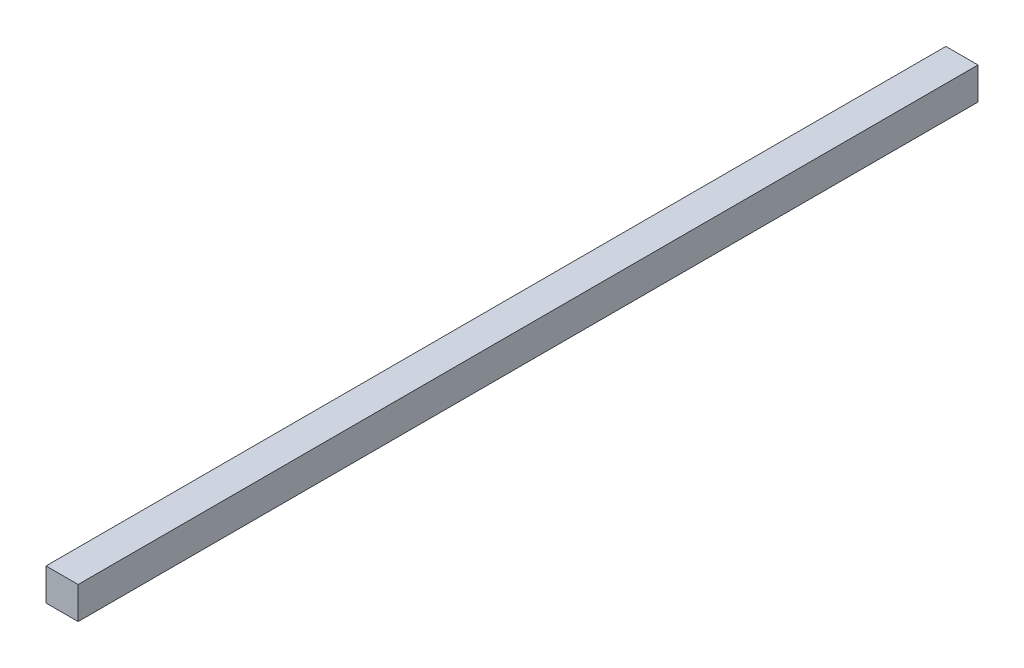
ISO-10303-21;
HEADER;
FILE_DESCRIPTION(('STEP AP214'),'2;1');
FILE_NAME('part.step','',(''),(''),'','','');
FILE_SCHEMA(('AUTOMOTIVE_DESIGN { 1 0 10303 214 1 1 1 1 }'));
ENDSEC;
DATA;
#1=APPLICATION_CONTEXT('core data for automotive mechanical design processes');
#2=APPLICATION_PROTOCOL_DEFINITION('international standard','automotive_design',2000,#1);
#3=PRODUCT_CONTEXT('',#1,'mechanical');
#4=PRODUCT('Part','Part','',(#3));
#5=PRODUCT_RELATED_PRODUCT_CATEGORY('part','',(#4));
#6=PRODUCT_DEFINITION_FORMATION('','',#4);
#7=PRODUCT_DEFINITION_CONTEXT('part definition',#1,'design');
#8=PRODUCT_DEFINITION('design','',#6,#7);
#9=PRODUCT_DEFINITION_SHAPE('','',#8);
#10=(LENGTH_UNIT() NAMED_UNIT(*) SI_UNIT(.MILLI.,.METRE.));
#11=(NAMED_UNIT(*) PLANE_ANGLE_UNIT() SI_UNIT($,.RADIAN.));
#12=(NAMED_UNIT(*) SI_UNIT($,.STERADIAN.) SOLID_ANGLE_UNIT());
#13=UNCERTAINTY_MEASURE_WITH_UNIT(LENGTH_MEASURE(1.E-05),#10,'distance_accuracy_value','');
#14=(GEOMETRIC_REPRESENTATION_CONTEXT(3) GLOBAL_UNCERTAINTY_ASSIGNED_CONTEXT((#13)) GLOBAL_UNIT_ASSIGNED_CONTEXT((#10,
#11,#12)) REPRESENTATION_CONTEXT('',''));
#15=CARTESIAN_POINT('',(0.,0.,0.));
#16=DIRECTION('',(0.,0.,1.));
#17=DIRECTION('',(1.,0.,0.));
#18=AXIS2_PLACEMENT_3D('',#15,#16,#17);
#19=CARTESIAN_POINT('',(7.5,-7.5,420.));
#20=DIRECTION('',(-1.,0.,0.));
#21=DIRECTION('',(0.,0.,1.));
#22=AXIS2_PLACEMENT_3D('',#19,#20,#21);
#23=PLANE('',#22);
#24=DIRECTION('',(0.,1.,0.));
#25=VECTOR('',#24,1.);
#26=CARTESIAN_POINT('',(7.5,-7.5,0.));
#27=LINE('',#26,#25);
#28=CARTESIAN_POINT('',(7.5,-7.5,0.));
#29=VERTEX_POINT('',#28);
#30=CARTESIAN_POINT('',(7.5,7.5,0.));
#31=VERTEX_POINT('',#30);
#32=EDGE_CURVE('E96',#29,#31,#27,.T.);
#33=ORIENTED_EDGE('',*,*,#32,.T.);
#34=DIRECTION('',(0.,0.,-1.));
#35=VECTOR('',#34,1.);
#36=CARTESIAN_POINT('',(7.5,7.5,420.));
#37=LINE('',#36,#35);
#38=CARTESIAN_POINT('',(7.5,7.5,420.));
#39=VERTEX_POINT('',#38);
#40=EDGE_CURVE('E11',#39,#31,#37,.T.);
#41=ORIENTED_EDGE('',*,*,#40,.F.);
#42=DIRECTION('',(0.,1.,0.));
#43=VECTOR('',#42,1.);
#44=CARTESIAN_POINT('',(7.5,-7.5,420.));
#45=LINE('',#44,#43);
#46=CARTESIAN_POINT('',(7.5,-7.5,420.));
#47=VERTEX_POINT('',#46);
#48=EDGE_CURVE('E84',#47,#39,#45,.T.);
#49=ORIENTED_EDGE('',*,*,#48,.F.);
#50=DIRECTION('',(0.,0.,-1.));
#51=VECTOR('',#50,1.);
#52=CARTESIAN_POINT('',(7.5,-7.5,420.));
#53=LINE('',#52,#51);
#54=EDGE_CURVE('E92',#47,#29,#53,.T.);
#55=ORIENTED_EDGE('',*,*,#54,.T.);
#56=EDGE_LOOP('',(#33,#41,#49,#55));
#57=FACE_BOUND('',#56,.T.);
#58=ADVANCED_FACE('F33',(#57),#23,.F.);
#59=CARTESIAN_POINT('',(-7.5,7.5,420.));
#60=DIRECTION('',(0.,-1.,0.));
#61=DIRECTION('',(0.,0.,-1.));
#62=AXIS2_PLACEMENT_3D('',#59,#60,#61);
#63=PLANE('',#62);
#64=DIRECTION('',(-1.,0.,0.));
#65=VECTOR('',#64,1.);
#66=CARTESIAN_POINT('',(-7.5,7.5,0.));
#67=LINE('',#66,#65);
#68=CARTESIAN_POINT('',(-7.5,7.5,0.));
#69=VERTEX_POINT('',#68);
#70=EDGE_CURVE('E88',#31,#69,#67,.T.);
#71=ORIENTED_EDGE('',*,*,#70,.T.);
#72=DIRECTION('',(0.,0.,-1.));
#73=VECTOR('',#72,1.);
#74=CARTESIAN_POINT('',(-7.5,7.5,420.));
#75=LINE('',#74,#73);
#76=CARTESIAN_POINT('',(-7.5,7.5,420.));
#77=VERTEX_POINT('',#76);
#78=EDGE_CURVE('E41',#77,#69,#75,.T.);
#79=ORIENTED_EDGE('',*,*,#78,.F.);
#80=DIRECTION('',(-1.,0.,0.));
#81=VECTOR('',#80,1.);
#82=CARTESIAN_POINT('',(-7.5,7.5,420.));
#83=LINE('',#82,#81);
#84=EDGE_CURVE('E79',#39,#77,#83,.T.);
#85=ORIENTED_EDGE('',*,*,#84,.F.);
#86=ORIENTED_EDGE('',*,*,#40,.T.);
#87=EDGE_LOOP('',(#71,#79,#85,#86));
#88=FACE_BOUND('',#87,.T.);
#89=ADVANCED_FACE('F87',(#88),#63,.F.);
#90=CARTESIAN_POINT('',(-7.5,-7.5,420.));
#91=DIRECTION('',(1.,0.,0.));
#92=DIRECTION('',(0.,0.,-1.));
#93=AXIS2_PLACEMENT_3D('',#90,#91,#92);
#94=PLANE('',#93);
#95=DIRECTION('',(0.,-1.,0.));
#96=VECTOR('',#95,1.);
#97=CARTESIAN_POINT('',(-7.5,-7.5,0.));
#98=LINE('',#97,#96);
#99=CARTESIAN_POINT('',(-7.5,-7.5,0.));
#100=VERTEX_POINT('',#99);
#101=EDGE_CURVE('E66',#69,#100,#98,.T.);
#102=ORIENTED_EDGE('',*,*,#101,.T.);
#103=DIRECTION('',(0.,0.,-1.));
#104=VECTOR('',#103,1.);
#105=CARTESIAN_POINT('',(-7.5,-7.5,420.));
#106=LINE('',#105,#104);
#107=CARTESIAN_POINT('',(-7.5,-7.5,420.));
#108=VERTEX_POINT('',#107);
#109=EDGE_CURVE('E89',#108,#100,#106,.T.);
#110=ORIENTED_EDGE('',*,*,#109,.F.);
#111=DIRECTION('',(0.,-1.,0.));
#112=VECTOR('',#111,1.);
#113=CARTESIAN_POINT('',(-7.5,-7.5,420.));
#114=LINE('',#113,#112);
#115=EDGE_CURVE('E82',#77,#108,#114,.T.);
#116=ORIENTED_EDGE('',*,*,#115,.F.);
#117=ORIENTED_EDGE('',*,*,#78,.T.);
#118=EDGE_LOOP('',(#102,#110,#116,#117));
#119=FACE_BOUND('',#118,.T.);
#120=ADVANCED_FACE('F90',(#119),#94,.F.);
#121=CARTESIAN_POINT('',(-7.5,-7.5,420.));
#122=DIRECTION('',(0.,1.,0.));
#123=DIRECTION('',(0.,0.,1.));
#124=AXIS2_PLACEMENT_3D('',#121,#122,#123);
#125=PLANE('',#124);
#126=DIRECTION('',(1.,0.,0.));
#127=VECTOR('',#126,1.);
#128=CARTESIAN_POINT('',(-7.5,-7.5,0.));
#129=LINE('',#128,#127);
#130=EDGE_CURVE('E72',#100,#29,#129,.T.);
#131=ORIENTED_EDGE('',*,*,#130,.T.);
#132=ORIENTED_EDGE('',*,*,#54,.F.);
#133=DIRECTION('',(1.,0.,0.));
#134=VECTOR('',#133,1.);
#135=CARTESIAN_POINT('',(-7.5,-7.5,420.));
#136=LINE('',#135,#134);
#137=EDGE_CURVE('E49',#108,#47,#136,.T.);
#138=ORIENTED_EDGE('',*,*,#137,.F.);
#139=ORIENTED_EDGE('',*,*,#109,.T.);
#140=EDGE_LOOP('',(#131,#132,#138,#139));
#141=FACE_BOUND('',#140,.T.);
#142=ADVANCED_FACE('F103',(#141),#125,.F.);
#143=CARTESIAN_POINT('',(0.,0.,420.));
#144=DIRECTION('',(0.,0.,-1.));
#145=DIRECTION('',(-1.,0.,0.));
#146=AXIS2_PLACEMENT_3D('',#143,#144,#145);
#147=PLANE('',#146);
#148=ORIENTED_EDGE('',*,*,#48,.T.);
#149=ORIENTED_EDGE('',*,*,#84,.T.);
#150=ORIENTED_EDGE('',*,*,#115,.T.);
#151=ORIENTED_EDGE('',*,*,#137,.T.);
#152=EDGE_LOOP('',(#148,#149,#150,#151));
#153=FACE_BOUND('',#152,.T.);
#154=ADVANCED_FACE('F80',(#153),#147,.F.);
#155=CARTESIAN_POINT('',(0.,0.,0.));
#156=DIRECTION('',(0.,0.,-1.));
#157=DIRECTION('',(-1.,0.,0.));
#158=AXIS2_PLACEMENT_3D('',#155,#156,#157);
#159=PLANE('',#158);
#160=ORIENTED_EDGE('',*,*,#32,.F.);
#161=ORIENTED_EDGE('',*,*,#130,.F.);
#162=ORIENTED_EDGE('',*,*,#101,.F.);
#163=ORIENTED_EDGE('',*,*,#70,.F.);
#164=EDGE_LOOP('',(#160,#161,#162,#163));
#165=FACE_BOUND('',#164,.T.);
#166=ADVANCED_FACE('F106',(#165),#159,.T.);
#167=CLOSED_SHELL('',(#58,#89,#120,#142,#154,#166));
#168=MANIFOLD_SOLID_BREP('B2',#167);
#169=ADVANCED_BREP_SHAPE_REPRESENTATION('',(#18,#168),#14);
#170=SHAPE_DEFINITION_REPRESENTATION(#9,#169);
ENDSEC;
END-ISO-10303-21;
